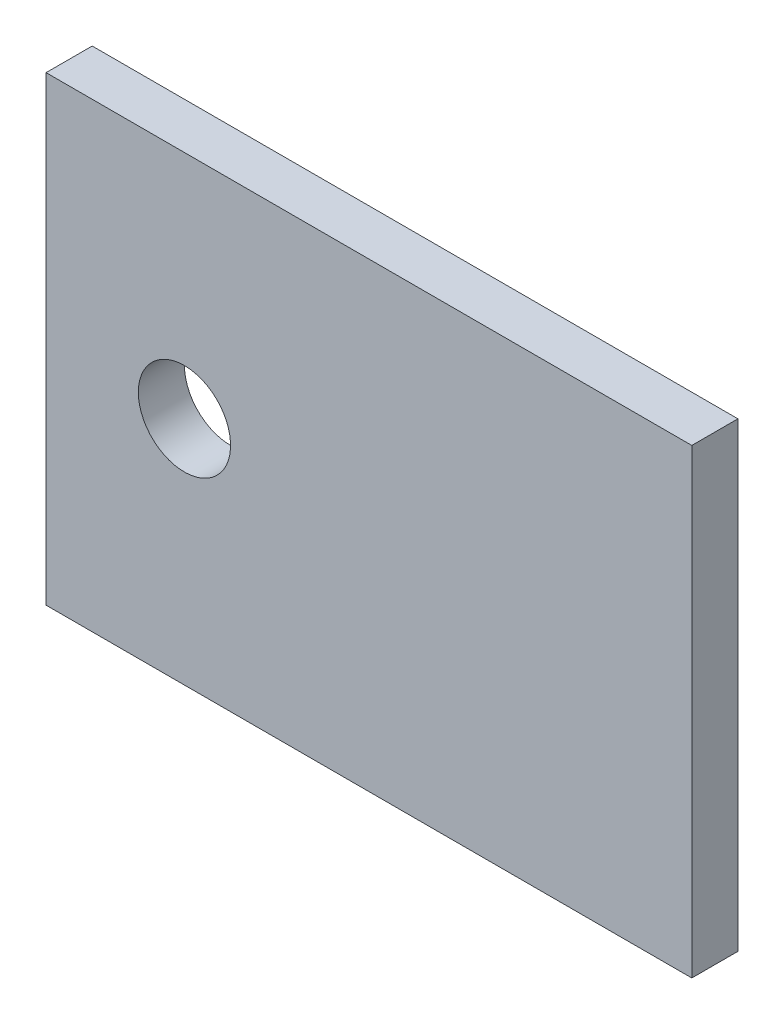
ISO-10303-21;
HEADER;
FILE_DESCRIPTION(('STEP AP214'),'2;1');
FILE_NAME('part.step','',(''),(''),'','','');
FILE_SCHEMA(('AUTOMOTIVE_DESIGN { 1 0 10303 214 1 1 1 1 }'));
ENDSEC;
DATA;
#1=APPLICATION_CONTEXT('core data for automotive mechanical design processes');
#2=APPLICATION_PROTOCOL_DEFINITION('international standard','automotive_design',2000,#1);
#3=PRODUCT_CONTEXT('',#1,'mechanical');
#4=PRODUCT('Part','Part','',(#3));
#5=PRODUCT_RELATED_PRODUCT_CATEGORY('part','',(#4));
#6=PRODUCT_DEFINITION_FORMATION('','',#4);
#7=PRODUCT_DEFINITION_CONTEXT('part definition',#1,'design');
#8=PRODUCT_DEFINITION('design','',#6,#7);
#9=PRODUCT_DEFINITION_SHAPE('','',#8);
#10=(LENGTH_UNIT() NAMED_UNIT(*) SI_UNIT(.MILLI.,.METRE.));
#11=(NAMED_UNIT(*) PLANE_ANGLE_UNIT() SI_UNIT($,.RADIAN.));
#12=(NAMED_UNIT(*) SI_UNIT($,.STERADIAN.) SOLID_ANGLE_UNIT());
#13=UNCERTAINTY_MEASURE_WITH_UNIT(LENGTH_MEASURE(1.E-05),#10,'distance_accuracy_value','');
#14=(GEOMETRIC_REPRESENTATION_CONTEXT(3) GLOBAL_UNCERTAINTY_ASSIGNED_CONTEXT((#13)) GLOBAL_UNIT_ASSIGNED_CONTEXT((#10,
#11,#12)) REPRESENTATION_CONTEXT('',''));
#15=CARTESIAN_POINT('',(0.,0.,0.));
#16=DIRECTION('',(0.,0.,1.));
#17=DIRECTION('',(1.,0.,0.));
#18=AXIS2_PLACEMENT_3D('',#15,#16,#17);
#19=CARTESIAN_POINT('',(35.,-25.,2.5));
#20=DIRECTION('',(0.,1.,0.));
#21=DIRECTION('',(0.,0.,1.));
#22=AXIS2_PLACEMENT_3D('',#19,#20,#21);
#23=PLANE('',#22);
#24=DIRECTION('',(0.,0.,-1.));
#25=VECTOR('',#24,1.);
#26=CARTESIAN_POINT('',(-35.,-25.,2.5));
#27=LINE('',#26,#25);
#28=CARTESIAN_POINT('',(-35.,-25.,2.5));
#29=VERTEX_POINT('',#28);
#30=CARTESIAN_POINT('',(-35.,-25.,-2.5));
#31=VERTEX_POINT('',#30);
#32=EDGE_CURVE('E111',#29,#31,#27,.T.);
#33=ORIENTED_EDGE('',*,*,#32,.T.);
#34=DIRECTION('',(-1.,0.,0.));
#35=VECTOR('',#34,1.);
#36=CARTESIAN_POINT('',(35.,-25.,-2.5));
#37=LINE('',#36,#35);
#38=CARTESIAN_POINT('',(35.,-25.,-2.5));
#39=VERTEX_POINT('',#38);
#40=EDGE_CURVE('E12',#39,#31,#37,.T.);
#41=ORIENTED_EDGE('',*,*,#40,.F.);
#42=DIRECTION('',(0.,0.,-1.));
#43=VECTOR('',#42,1.);
#44=CARTESIAN_POINT('',(35.,-25.,2.5));
#45=LINE('',#44,#43);
#46=CARTESIAN_POINT('',(35.,-25.,2.5));
#47=VERTEX_POINT('',#46);
#48=EDGE_CURVE('E99',#47,#39,#45,.T.);
#49=ORIENTED_EDGE('',*,*,#48,.F.);
#50=DIRECTION('',(-1.,0.,0.));
#51=VECTOR('',#50,1.);
#52=CARTESIAN_POINT('',(35.,-25.,2.5));
#53=LINE('',#52,#51);
#54=EDGE_CURVE('E107',#47,#29,#53,.T.);
#55=ORIENTED_EDGE('',*,*,#54,.T.);
#56=EDGE_LOOP('',(#33,#41,#49,#55));
#57=FACE_BOUND('',#56,.T.);
#58=ADVANCED_FACE('F48',(#57),#23,.F.);
#59=CARTESIAN_POINT('',(35.,-25.,-2.5));
#60=DIRECTION('',(0.,0.,1.));
#61=DIRECTION('',(1.,0.,0.));
#62=AXIS2_PLACEMENT_3D('',#59,#60,#61);
#63=PLANE('',#62);
#64=CARTESIAN_POINT('',(-20.,0.,-2.5));
#65=DIRECTION('',(0.,0.,-1.));
#66=DIRECTION('',(-1.,0.,0.));
#67=AXIS2_PLACEMENT_3D('',#64,#65,#66);
#68=CIRCLE('',#67,5.);
#69=CARTESIAN_POINT('',(-25.,0.,-2.5));
#70=VERTEX_POINT('',#69);
#71=EDGE_CURVE('E127',#70,#70,#68,.T.);
#72=ORIENTED_EDGE('',*,*,#71,.F.);
#73=EDGE_LOOP('',(#72));
#74=FACE_BOUND('',#73,.T.);
#75=DIRECTION('',(0.,1.,0.));
#76=VECTOR('',#75,1.);
#77=CARTESIAN_POINT('',(-35.,-25.,-2.5));
#78=LINE('',#77,#76);
#79=CARTESIAN_POINT('',(-35.,25.,-2.5));
#80=VERTEX_POINT('',#79);
#81=EDGE_CURVE('E103',#31,#80,#78,.T.);
#82=ORIENTED_EDGE('',*,*,#81,.T.);
#83=DIRECTION('',(-1.,0.,0.));
#84=VECTOR('',#83,1.);
#85=CARTESIAN_POINT('',(35.,25.,-2.5));
#86=LINE('',#85,#84);
#87=CARTESIAN_POINT('',(35.,25.,-2.5));
#88=VERTEX_POINT('',#87);
#89=EDGE_CURVE('E56',#88,#80,#86,.T.);
#90=ORIENTED_EDGE('',*,*,#89,.F.);
#91=DIRECTION('',(0.,1.,0.));
#92=VECTOR('',#91,1.);
#93=CARTESIAN_POINT('',(35.,-25.,-2.5));
#94=LINE('',#93,#92);
#95=EDGE_CURVE('E94',#39,#88,#94,.T.);
#96=ORIENTED_EDGE('',*,*,#95,.F.);
#97=ORIENTED_EDGE('',*,*,#40,.T.);
#98=EDGE_LOOP('',(#82,#90,#96,#97));
#99=FACE_BOUND('',#98,.T.);
#100=ADVANCED_FACE('F102',(#74,#99),#63,.F.);
#101=CARTESIAN_POINT('',(35.,25.,2.5));
#102=DIRECTION('',(0.,-1.,0.));
#103=DIRECTION('',(0.,0.,-1.));
#104=AXIS2_PLACEMENT_3D('',#101,#102,#103);
#105=PLANE('',#104);
#106=DIRECTION('',(0.,0.,1.));
#107=VECTOR('',#106,1.);
#108=CARTESIAN_POINT('',(-35.,25.,2.5));
#109=LINE('',#108,#107);
#110=CARTESIAN_POINT('',(-35.,25.,2.5));
#111=VERTEX_POINT('',#110);
#112=EDGE_CURVE('E81',#80,#111,#109,.T.);
#113=ORIENTED_EDGE('',*,*,#112,.T.);
#114=DIRECTION('',(-1.,0.,0.));
#115=VECTOR('',#114,1.);
#116=CARTESIAN_POINT('',(35.,25.,2.5));
#117=LINE('',#116,#115);
#118=CARTESIAN_POINT('',(35.,25.,2.5));
#119=VERTEX_POINT('',#118);
#120=EDGE_CURVE('E104',#119,#111,#117,.T.);
#121=ORIENTED_EDGE('',*,*,#120,.F.);
#122=DIRECTION('',(0.,0.,1.));
#123=VECTOR('',#122,1.);
#124=CARTESIAN_POINT('',(35.,25.,2.5));
#125=LINE('',#124,#123);
#126=EDGE_CURVE('E97',#88,#119,#125,.T.);
#127=ORIENTED_EDGE('',*,*,#126,.F.);
#128=ORIENTED_EDGE('',*,*,#89,.T.);
#129=EDGE_LOOP('',(#113,#121,#127,#128));
#130=FACE_BOUND('',#129,.T.);
#131=ADVANCED_FACE('F105',(#130),#105,.F.);
#132=CARTESIAN_POINT('',(35.,-25.,2.5));
#133=DIRECTION('',(0.,0.,-1.));
#134=DIRECTION('',(-1.,0.,0.));
#135=AXIS2_PLACEMENT_3D('',#132,#133,#134);
#136=PLANE('',#135);
#137=CARTESIAN_POINT('',(-20.,0.,2.5));
#138=DIRECTION('',(0.,0.,-1.));
#139=DIRECTION('',(-1.,0.,0.));
#140=AXIS2_PLACEMENT_3D('',#137,#138,#139);
#141=CIRCLE('',#140,5.);
#142=CARTESIAN_POINT('',(-25.,0.,2.5));
#143=VERTEX_POINT('',#142);
#144=EDGE_CURVE('E114',#143,#143,#141,.T.);
#145=ORIENTED_EDGE('',*,*,#144,.T.);
#146=EDGE_LOOP('',(#145));
#147=FACE_BOUND('',#146,.T.);
#148=DIRECTION('',(0.,-1.,0.));
#149=VECTOR('',#148,1.);
#150=CARTESIAN_POINT('',(-35.,-25.,2.5));
#151=LINE('',#150,#149);
#152=EDGE_CURVE('E87',#111,#29,#151,.T.);
#153=ORIENTED_EDGE('',*,*,#152,.T.);
#154=ORIENTED_EDGE('',*,*,#54,.F.);
#155=DIRECTION('',(0.,-1.,0.));
#156=VECTOR('',#155,1.);
#157=CARTESIAN_POINT('',(35.,-25.,2.5));
#158=LINE('',#157,#156);
#159=EDGE_CURVE('E64',#119,#47,#158,.T.);
#160=ORIENTED_EDGE('',*,*,#159,.F.);
#161=ORIENTED_EDGE('',*,*,#120,.T.);
#162=EDGE_LOOP('',(#153,#154,#160,#161));
#163=FACE_BOUND('',#162,.T.);
#164=ADVANCED_FACE('F119',(#147,#163),#136,.F.);
#165=CARTESIAN_POINT('',(35.,-25.,-2.5));
#166=DIRECTION('',(1.,0.,0.));
#167=DIRECTION('',(0.,0.,-1.));
#168=AXIS2_PLACEMENT_3D('',#165,#166,#167);
#169=PLANE('',#168);
#170=ORIENTED_EDGE('',*,*,#48,.T.);
#171=ORIENTED_EDGE('',*,*,#95,.T.);
#172=ORIENTED_EDGE('',*,*,#126,.T.);
#173=ORIENTED_EDGE('',*,*,#159,.T.);
#174=EDGE_LOOP('',(#170,#171,#172,#173));
#175=FACE_BOUND('',#174,.T.);
#176=ADVANCED_FACE('F95',(#175),#169,.T.);
#177=CARTESIAN_POINT('',(-35.,-25.,-2.5));
#178=DIRECTION('',(1.,0.,0.));
#179=DIRECTION('',(0.,0.,-1.));
#180=AXIS2_PLACEMENT_3D('',#177,#178,#179);
#181=PLANE('',#180);
#182=ORIENTED_EDGE('',*,*,#32,.F.);
#183=ORIENTED_EDGE('',*,*,#152,.F.);
#184=ORIENTED_EDGE('',*,*,#112,.F.);
#185=ORIENTED_EDGE('',*,*,#81,.F.);
#186=EDGE_LOOP('',(#182,#183,#184,#185));
#187=FACE_BOUND('',#186,.T.);
#188=ADVANCED_FACE('F122',(#187),#181,.F.);
#189=CARTESIAN_POINT('',(-20.,0.,-2.5));
#190=DIRECTION('',(0.,0.,-1.));
#191=DIRECTION('',(-1.,0.,0.));
#192=AXIS2_PLACEMENT_3D('',#189,#190,#191);
#193=CYLINDRICAL_SURFACE('',#192,5.);
#194=ORIENTED_EDGE('',*,*,#144,.F.);
#195=EDGE_LOOP('',(#194));
#196=FACE_BOUND('',#195,.T.);
#197=ORIENTED_EDGE('',*,*,#71,.T.);
#198=EDGE_LOOP('',(#197));
#199=FACE_BOUND('',#198,.T.);
#200=ADVANCED_FACE('F131',(#196,#199),#193,.F.);
#201=CLOSED_SHELL('',(#58,#100,#131,#164,#176,#188,#200));
#202=MANIFOLD_SOLID_BREP('B2',#201);
#203=ADVANCED_BREP_SHAPE_REPRESENTATION('',(#18,#202),#14);
#204=SHAPE_DEFINITION_REPRESENTATION(#9,#203);
ENDSEC;
END-ISO-10303-21;
